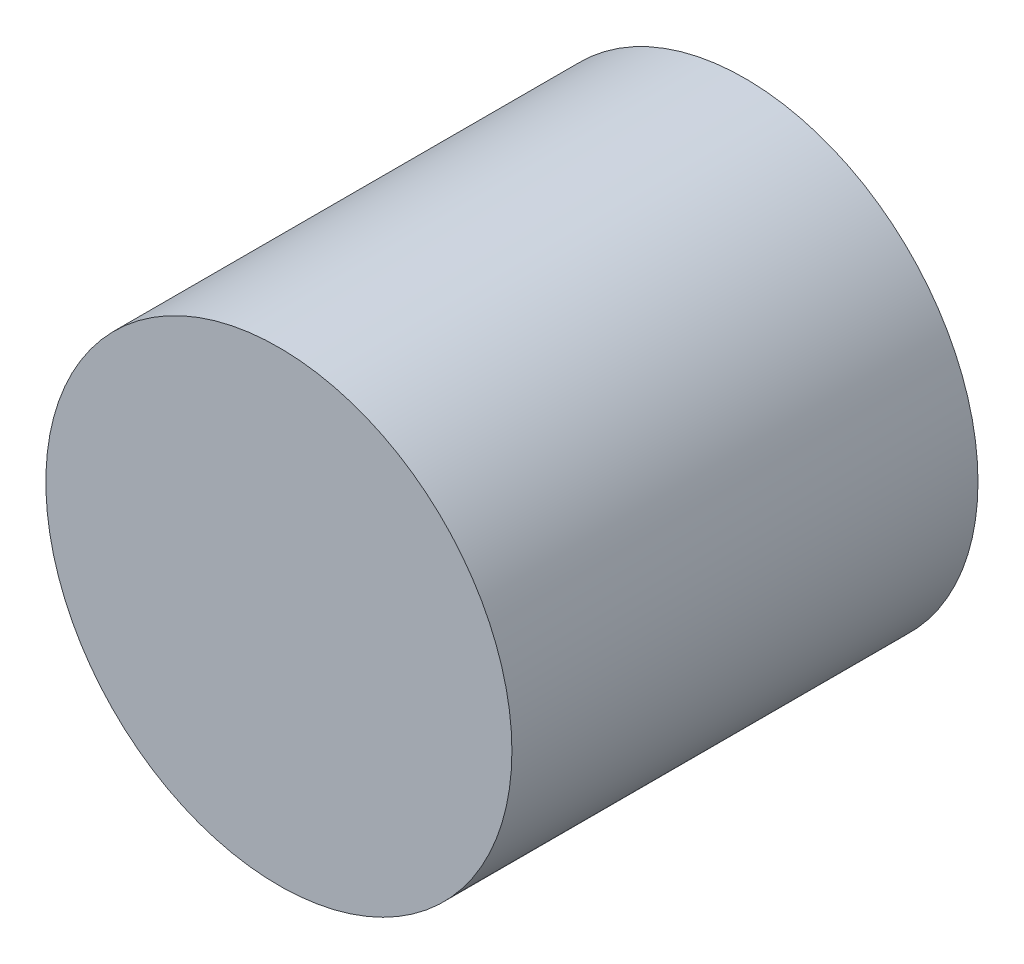
ISO-10303-21;
HEADER;
FILE_DESCRIPTION(('STEP AP214'),'2;1');
FILE_NAME('part.step','',(''),(''),'','','');
FILE_SCHEMA(('AUTOMOTIVE_DESIGN { 1 0 10303 214 1 1 1 1 }'));
ENDSEC;
DATA;
#1=APPLICATION_CONTEXT('core data for automotive mechanical design processes');
#2=APPLICATION_PROTOCOL_DEFINITION('international standard','automotive_design',2000,#1);
#3=PRODUCT_CONTEXT('',#1,'mechanical');
#4=PRODUCT('Part','Part','',(#3));
#5=PRODUCT_RELATED_PRODUCT_CATEGORY('part','',(#4));
#6=PRODUCT_DEFINITION_FORMATION('','',#4);
#7=PRODUCT_DEFINITION_CONTEXT('part definition',#1,'design');
#8=PRODUCT_DEFINITION('design','',#6,#7);
#9=PRODUCT_DEFINITION_SHAPE('','',#8);
#10=(LENGTH_UNIT() NAMED_UNIT(*) SI_UNIT(.MILLI.,.METRE.));
#11=(NAMED_UNIT(*) PLANE_ANGLE_UNIT() SI_UNIT($,.RADIAN.));
#12=(NAMED_UNIT(*) SI_UNIT($,.STERADIAN.) SOLID_ANGLE_UNIT());
#13=UNCERTAINTY_MEASURE_WITH_UNIT(LENGTH_MEASURE(1.E-05),#10,'distance_accuracy_value','');
#14=(GEOMETRIC_REPRESENTATION_CONTEXT(3) GLOBAL_UNCERTAINTY_ASSIGNED_CONTEXT((#13)) GLOBAL_UNIT_ASSIGNED_CONTEXT((#10,
#11,#12)) REPRESENTATION_CONTEXT('',''));
#15=CARTESIAN_POINT('',(0.,0.,0.));
#16=DIRECTION('',(0.,0.,1.));
#17=DIRECTION('',(1.,0.,0.));
#18=AXIS2_PLACEMENT_3D('',#15,#16,#17);
#19=CARTESIAN_POINT('',(0.,0.,25.));
#20=DIRECTION('',(0.,0.,-1.));
#21=DIRECTION('',(-1.,0.,0.));
#22=AXIS2_PLACEMENT_3D('',#19,#20,#21);
#23=CYLINDRICAL_SURFACE('',#22,12.5);
#24=CARTESIAN_POINT('',(0.,0.,25.));
#25=DIRECTION('',(0.,0.,1.));
#26=DIRECTION('',(1.,0.,0.));
#27=AXIS2_PLACEMENT_3D('',#24,#25,#26);
#28=CIRCLE('',#27,12.5);
#29=CARTESIAN_POINT('',(12.5,0.,25.));
#30=VERTEX_POINT('',#29);
#31=EDGE_CURVE('E10',#30,#30,#28,.T.);
#32=ORIENTED_EDGE('',*,*,#31,.F.);
#33=EDGE_LOOP('',(#32));
#34=FACE_BOUND('',#33,.T.);
#35=CARTESIAN_POINT('',(0.,0.,0.));
#36=DIRECTION('',(0.,0.,1.));
#37=DIRECTION('',(1.,0.,0.));
#38=AXIS2_PLACEMENT_3D('',#35,#36,#37);
#39=CIRCLE('',#38,12.5);
#40=CARTESIAN_POINT('',(12.5,0.,0.));
#41=VERTEX_POINT('',#40);
#42=EDGE_CURVE('E34',#41,#41,#39,.T.);
#43=ORIENTED_EDGE('',*,*,#42,.T.);
#44=EDGE_LOOP('',(#43));
#45=FACE_BOUND('',#44,.T.);
#46=ADVANCED_FACE('F31',(#34,#45),#23,.T.);
#47=CARTESIAN_POINT('',(0.,0.,25.));
#48=DIRECTION('',(0.,0.,1.));
#49=DIRECTION('',(1.,0.,0.));
#50=AXIS2_PLACEMENT_3D('',#47,#48,#49);
#51=PLANE('',#50);
#52=ORIENTED_EDGE('',*,*,#31,.T.);
#53=EDGE_LOOP('',(#52));
#54=FACE_BOUND('',#53,.T.);
#55=ADVANCED_FACE('F46',(#54),#51,.T.);
#56=CARTESIAN_POINT('',(0.,0.,0.));
#57=DIRECTION('',(0.,0.,1.));
#58=DIRECTION('',(1.,0.,0.));
#59=AXIS2_PLACEMENT_3D('',#56,#57,#58);
#60=PLANE('',#59);
#61=ORIENTED_EDGE('',*,*,#42,.F.);
#62=EDGE_LOOP('',(#61));
#63=FACE_BOUND('',#62,.T.);
#64=ADVANCED_FACE('F44',(#63),#60,.F.);
#65=CLOSED_SHELL('',(#46,#55,#64));
#66=MANIFOLD_SOLID_BREP('B2',#65);
#67=ADVANCED_BREP_SHAPE_REPRESENTATION('',(#18,#66),#14);
#68=SHAPE_DEFINITION_REPRESENTATION(#9,#67);
ENDSEC;
END-ISO-10303-21;
